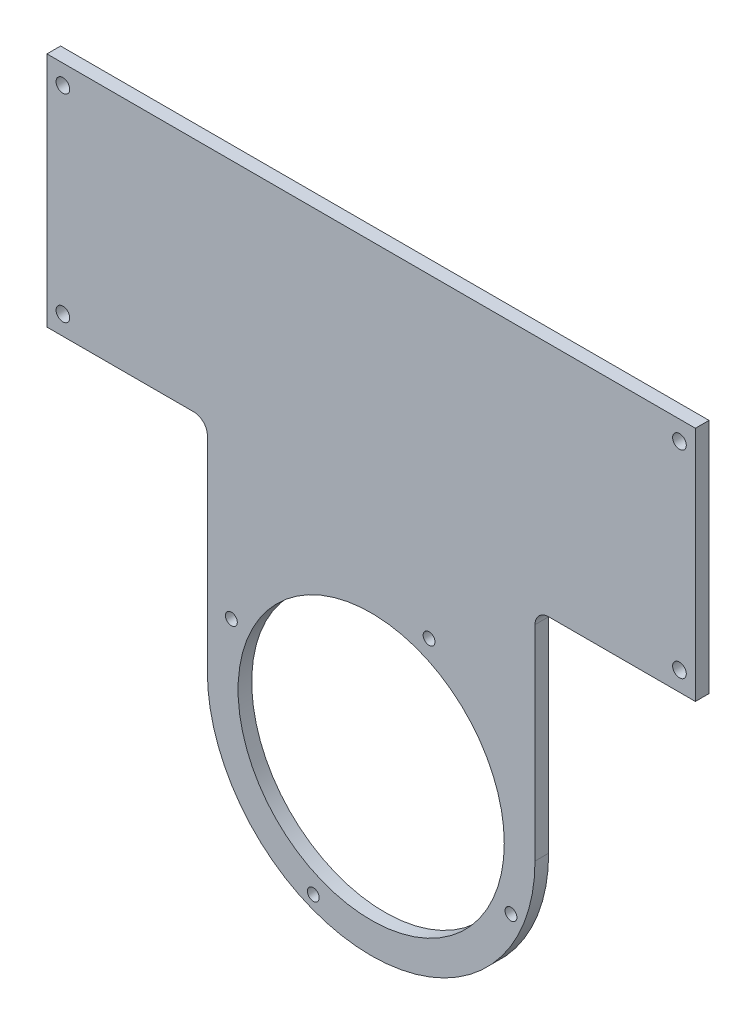
ISO-10303-21;
HEADER;
FILE_DESCRIPTION(('STEP AP214'),'2;1');
FILE_NAME('part.step','',(''),(''),'','','');
FILE_SCHEMA(('AUTOMOTIVE_DESIGN { 1 0 10303 214 1 1 1 1 }'));
ENDSEC;
DATA;
#1=APPLICATION_CONTEXT('core data for automotive mechanical design processes');
#2=APPLICATION_PROTOCOL_DEFINITION('international standard','automotive_design',2000,#1);
#3=PRODUCT_CONTEXT('',#1,'mechanical');
#4=PRODUCT('Part','Part','',(#3));
#5=PRODUCT_RELATED_PRODUCT_CATEGORY('part','',(#4));
#6=PRODUCT_DEFINITION_FORMATION('','',#4);
#7=PRODUCT_DEFINITION_CONTEXT('part definition',#1,'design');
#8=PRODUCT_DEFINITION('design','',#6,#7);
#9=PRODUCT_DEFINITION_SHAPE('','',#8);
#10=(LENGTH_UNIT() NAMED_UNIT(*) SI_UNIT(.MILLI.,.METRE.));
#11=(NAMED_UNIT(*) PLANE_ANGLE_UNIT() SI_UNIT($,.RADIAN.));
#12=(NAMED_UNIT(*) SI_UNIT($,.STERADIAN.) SOLID_ANGLE_UNIT());
#13=UNCERTAINTY_MEASURE_WITH_UNIT(LENGTH_MEASURE(1.E-05),#10,'distance_accuracy_value','');
#14=(GEOMETRIC_REPRESENTATION_CONTEXT(3) GLOBAL_UNCERTAINTY_ASSIGNED_CONTEXT((#13)) GLOBAL_UNIT_ASSIGNED_CONTEXT((#10,
#11,#12)) REPRESENTATION_CONTEXT('',''));
#15=CARTESIAN_POINT('',(0.,0.,0.));
#16=DIRECTION('',(0.,0.,1.));
#17=DIRECTION('',(1.,0.,0.));
#18=AXIS2_PLACEMENT_3D('',#15,#16,#17);
#19=CARTESIAN_POINT('',(0.,0.,3.));
#20=DIRECTION('',(0.,0.,1.));
#21=DIRECTION('',(1.,0.,0.));
#22=AXIS2_PLACEMENT_3D('',#19,#20,#21);
#23=PLANE('',#22);
#24=CARTESIAN_POINT('',(-30.7189944560003,12.7242241261393,3.));
#25=DIRECTION('',(0.,0.,1.));
#26=DIRECTION('',(1.,0.,0.));
#27=AXIS2_PLACEMENT_3D('',#24,#25,#26);
#28=CIRCLE('',#27,1.30000000000028);
#29=CARTESIAN_POINT('',(-29.418994456,12.7242241261393,3.));
#30=VERTEX_POINT('',#29);
#31=EDGE_CURVE('E482',#30,#30,#28,.T.);
#32=ORIENTED_EDGE('',*,*,#31,.F.);
#33=EDGE_LOOP('',(#32));
#34=FACE_BOUND('',#33,.T.);
#35=CARTESIAN_POINT('',(-12.7242241261393,-30.7189944560003,3.));
#36=DIRECTION('',(0.,0.,1.));
#37=DIRECTION('',(1.,0.,0.));
#38=AXIS2_PLACEMENT_3D('',#35,#36,#37);
#39=CIRCLE('',#38,1.30000000000018);
#40=CARTESIAN_POINT('',(-11.4242241261391,-30.7189944560003,3.));
#41=VERTEX_POINT('',#40);
#42=EDGE_CURVE('E486',#41,#41,#39,.T.);
#43=ORIENTED_EDGE('',*,*,#42,.F.);
#44=EDGE_LOOP('',(#43));
#45=FACE_BOUND('',#44,.T.);
#46=CARTESIAN_POINT('',(30.7189944560003,-12.7242241261393,3.));
#47=DIRECTION('',(0.,0.,1.));
#48=DIRECTION('',(1.,0.,0.));
#49=AXIS2_PLACEMENT_3D('',#46,#47,#48);
#50=CIRCLE('',#49,1.30000000000009);
#51=CARTESIAN_POINT('',(32.0189944560004,-12.7242241261393,3.));
#52=VERTEX_POINT('',#51);
#53=EDGE_CURVE('E499',#52,#52,#50,.T.);
#54=ORIENTED_EDGE('',*,*,#53,.F.);
#55=EDGE_LOOP('',(#54));
#56=FACE_BOUND('',#55,.T.);
#57=CARTESIAN_POINT('',(12.7242241261393,30.7189944560003,3.));
#58=DIRECTION('',(0.,0.,1.));
#59=DIRECTION('',(1.,0.,0.));
#60=AXIS2_PLACEMENT_3D('',#57,#58,#59);
#61=CIRCLE('',#60,1.3);
#62=CARTESIAN_POINT('',(14.0242241261393,30.7189944560003,3.));
#63=VERTEX_POINT('',#62);
#64=EDGE_CURVE('E507',#63,#63,#61,.T.);
#65=ORIENTED_EDGE('',*,*,#64,.F.);
#66=EDGE_LOOP('',(#65));
#67=FACE_BOUND('',#66,.T.);
#68=CARTESIAN_POINT('',(0.,0.,3.));
#69=DIRECTION('',(0.,0.,1.));
#70=DIRECTION('',(1.,0.,0.));
#71=AXIS2_PLACEMENT_3D('',#68,#69,#70);
#72=CIRCLE('',#71,29.25);
#73=CARTESIAN_POINT('',(29.25,0.,3.));
#74=VERTEX_POINT('',#73);
#75=EDGE_CURVE('E199',#74,#74,#72,.T.);
#76=ORIENTED_EDGE('',*,*,#75,.F.);
#77=EDGE_LOOP('',(#76));
#78=FACE_BOUND('',#77,.T.);
#79=CARTESIAN_POINT('',(67.75,52.25,3.));
#80=DIRECTION('',(0.,0.,1.));
#81=DIRECTION('',(1.,0.,0.));
#82=AXIS2_PLACEMENT_3D('',#79,#80,#81);
#83=CIRCLE('',#82,1.5);
#84=CARTESIAN_POINT('',(69.25,52.25,3.));
#85=VERTEX_POINT('',#84);
#86=EDGE_CURVE('E192',#85,#85,#83,.T.);
#87=ORIENTED_EDGE('',*,*,#86,.F.);
#88=EDGE_LOOP('',(#87));
#89=FACE_BOUND('',#88,.T.);
#90=CARTESIAN_POINT('',(-67.75,95.75,3.));
#91=DIRECTION('',(0.,0.,1.));
#92=DIRECTION('',(1.,0.,0.));
#93=AXIS2_PLACEMENT_3D('',#90,#91,#92);
#94=CIRCLE('',#93,1.5);
#95=CARTESIAN_POINT('',(-66.25,95.75,3.));
#96=VERTEX_POINT('',#95);
#97=EDGE_CURVE('E214',#96,#96,#94,.T.);
#98=ORIENTED_EDGE('',*,*,#97,.F.);
#99=EDGE_LOOP('',(#98));
#100=FACE_BOUND('',#99,.T.);
#101=DIRECTION('',(0.,1.,0.));
#102=VECTOR('',#101,1.);
#103=CARTESIAN_POINT('',(36.,0.,3.));
#104=LINE('',#103,#102);
#105=CARTESIAN_POINT('',(36.,0.,3.));
#106=VERTEX_POINT('',#105);
#107=CARTESIAN_POINT('',(36.,45.,3.));
#108=VERTEX_POINT('',#107);
#109=EDGE_CURVE('E162',#106,#108,#104,.T.);
#110=ORIENTED_EDGE('',*,*,#109,.T.);
#111=CARTESIAN_POINT('',(39.,45.,3.));
#112=DIRECTION('',(0.,0.,1.));
#113=DIRECTION('',(1.,0.,0.));
#114=AXIS2_PLACEMENT_3D('',#111,#112,#113);
#115=CIRCLE('',#114,3.);
#116=CARTESIAN_POINT('',(39.,48.,3.));
#117=VERTEX_POINT('',#116);
#118=EDGE_CURVE('E123',#108,#117,#115,.F.);
#119=ORIENTED_EDGE('',*,*,#118,.T.);
#120=DIRECTION('',(1.,0.,0.));
#121=VECTOR('',#120,1.);
#122=CARTESIAN_POINT('',(36.,48.,3.));
#123=LINE('',#122,#121);
#124=CARTESIAN_POINT('',(71.25,48.,3.));
#125=VERTEX_POINT('',#124);
#126=EDGE_CURVE('E116',#117,#125,#123,.T.);
#127=ORIENTED_EDGE('',*,*,#126,.T.);
#128=DIRECTION('',(0.,1.,0.));
#129=VECTOR('',#128,1.);
#130=CARTESIAN_POINT('',(71.25,100.,3.));
#131=LINE('',#130,#129);
#132=CARTESIAN_POINT('',(71.25,100.,3.));
#133=VERTEX_POINT('',#132);
#134=EDGE_CURVE('E120',#125,#133,#131,.T.);
#135=ORIENTED_EDGE('',*,*,#134,.T.);
#136=DIRECTION('',(-1.,0.,0.));
#137=VECTOR('',#136,1.);
#138=CARTESIAN_POINT('',(-71.25,100.,3.));
#139=LINE('',#138,#137);
#140=CARTESIAN_POINT('',(-71.25,100.,3.));
#141=VERTEX_POINT('',#140);
#142=EDGE_CURVE('E139',#133,#141,#139,.T.);
#143=ORIENTED_EDGE('',*,*,#142,.T.);
#144=DIRECTION('',(0.,-1.,0.));
#145=VECTOR('',#144,1.);
#146=CARTESIAN_POINT('',(-71.25,100.,3.));
#147=LINE('',#146,#145);
#148=CARTESIAN_POINT('',(-71.25,48.,3.));
#149=VERTEX_POINT('',#148);
#150=EDGE_CURVE('E166',#141,#149,#147,.T.);
#151=ORIENTED_EDGE('',*,*,#150,.T.);
#152=DIRECTION('',(1.,0.,0.));
#153=VECTOR('',#152,1.);
#154=CARTESIAN_POINT('',(-71.25,48.,3.));
#155=LINE('',#154,#153);
#156=CARTESIAN_POINT('',(-39.,48.,3.));
#157=VERTEX_POINT('',#156);
#158=EDGE_CURVE('E169',#149,#157,#155,.T.);
#159=ORIENTED_EDGE('',*,*,#158,.T.);
#160=CARTESIAN_POINT('',(-39.,45.,3.));
#161=DIRECTION('',(0.,0.,1.));
#162=DIRECTION('',(1.,0.,0.));
#163=AXIS2_PLACEMENT_3D('',#160,#161,#162);
#164=CIRCLE('',#163,3.);
#165=CARTESIAN_POINT('',(-36.,45.,3.));
#166=VERTEX_POINT('',#165);
#167=EDGE_CURVE('E12',#157,#166,#164,.F.);
#168=ORIENTED_EDGE('',*,*,#167,.T.);
#169=DIRECTION('',(0.,-1.,0.));
#170=VECTOR('',#169,1.);
#171=CARTESIAN_POINT('',(-36.,0.,3.));
#172=LINE('',#171,#170);
#173=CARTESIAN_POINT('',(-36.,0.,3.));
#174=VERTEX_POINT('',#173);
#175=EDGE_CURVE('E171',#166,#174,#172,.T.);
#176=ORIENTED_EDGE('',*,*,#175,.T.);
#177=CARTESIAN_POINT('',(0.,0.,3.));
#178=DIRECTION('',(0.,0.,1.));
#179=DIRECTION('',(1.,0.,0.));
#180=AXIS2_PLACEMENT_3D('',#177,#178,#179);
#181=CIRCLE('',#180,36.);
#182=EDGE_CURVE('E175',#174,#106,#181,.T.);
#183=ORIENTED_EDGE('',*,*,#182,.T.);
#184=EDGE_LOOP('',(#110,#119,#127,#135,#143,#151,#159,#168,#176,#183));
#185=FACE_BOUND('',#184,.T.);
#186=CARTESIAN_POINT('',(67.75,95.75,3.));
#187=DIRECTION('',(0.,0.,1.));
#188=DIRECTION('',(1.,0.,0.));
#189=AXIS2_PLACEMENT_3D('',#186,#187,#188);
#190=CIRCLE('',#189,1.5);
#191=CARTESIAN_POINT('',(69.25,95.75,3.));
#192=VERTEX_POINT('',#191);
#193=EDGE_CURVE('E179',#192,#192,#190,.T.);
#194=ORIENTED_EDGE('',*,*,#193,.F.);
#195=EDGE_LOOP('',(#194));
#196=FACE_BOUND('',#195,.T.);
#197=CARTESIAN_POINT('',(-67.75,52.25,3.));
#198=DIRECTION('',(0.,0.,1.));
#199=DIRECTION('',(1.,0.,0.));
#200=AXIS2_PLACEMENT_3D('',#197,#198,#199);
#201=CIRCLE('',#200,1.5);
#202=CARTESIAN_POINT('',(-66.25,52.25,3.));
#203=VERTEX_POINT('',#202);
#204=EDGE_CURVE('E185',#203,#203,#201,.T.);
#205=ORIENTED_EDGE('',*,*,#204,.F.);
#206=EDGE_LOOP('',(#205));
#207=FACE_BOUND('',#206,.T.);
#208=ADVANCED_FACE('F39',(#34,#45,#56,#67,#78,#89,#100,#185,#196,#207),#23,.T.);
#209=CARTESIAN_POINT('',(0.,0.,0.));
#210=DIRECTION('',(0.,0.,1.));
#211=DIRECTION('',(1.,0.,0.));
#212=AXIS2_PLACEMENT_3D('',#209,#210,#211);
#213=PLANE('',#212);
#214=CARTESIAN_POINT('',(-30.7189944560003,12.7242241261393,0.));
#215=DIRECTION('',(0.,0.,1.));
#216=DIRECTION('',(1.,0.,0.));
#217=AXIS2_PLACEMENT_3D('',#214,#215,#216);
#218=CIRCLE('',#217,1.30000000000028);
#219=CARTESIAN_POINT('',(-29.418994456,12.7242241261393,0.));
#220=VERTEX_POINT('',#219);
#221=EDGE_CURVE('E480',#220,#220,#218,.T.);
#222=ORIENTED_EDGE('',*,*,#221,.T.);
#223=EDGE_LOOP('',(#222));
#224=FACE_BOUND('',#223,.T.);
#225=CARTESIAN_POINT('',(-12.7242241261393,-30.7189944560003,0.));
#226=DIRECTION('',(0.,0.,1.));
#227=DIRECTION('',(1.,0.,0.));
#228=AXIS2_PLACEMENT_3D('',#225,#226,#227);
#229=CIRCLE('',#228,1.30000000000018);
#230=CARTESIAN_POINT('',(-11.4242241261391,-30.7189944560003,0.));
#231=VERTEX_POINT('',#230);
#232=EDGE_CURVE('E497',#231,#231,#229,.T.);
#233=ORIENTED_EDGE('',*,*,#232,.T.);
#234=EDGE_LOOP('',(#233));
#235=FACE_BOUND('',#234,.T.);
#236=CARTESIAN_POINT('',(30.7189944560003,-12.7242241261393,0.));
#237=DIRECTION('',(0.,0.,1.));
#238=DIRECTION('',(1.,0.,0.));
#239=AXIS2_PLACEMENT_3D('',#236,#237,#238);
#240=CIRCLE('',#239,1.30000000000009);
#241=CARTESIAN_POINT('',(32.0189944560004,-12.7242241261393,0.));
#242=VERTEX_POINT('',#241);
#243=EDGE_CURVE('E504',#242,#242,#240,.T.);
#244=ORIENTED_EDGE('',*,*,#243,.T.);
#245=EDGE_LOOP('',(#244));
#246=FACE_BOUND('',#245,.T.);
#247=CARTESIAN_POINT('',(12.7242241261393,30.7189944560003,0.));
#248=DIRECTION('',(0.,0.,1.));
#249=DIRECTION('',(1.,0.,0.));
#250=AXIS2_PLACEMENT_3D('',#247,#248,#249);
#251=CIRCLE('',#250,1.3);
#252=CARTESIAN_POINT('',(14.0242241261393,30.7189944560003,0.));
#253=VERTEX_POINT('',#252);
#254=EDGE_CURVE('E512',#253,#253,#251,.T.);
#255=ORIENTED_EDGE('',*,*,#254,.T.);
#256=EDGE_LOOP('',(#255));
#257=FACE_BOUND('',#256,.T.);
#258=CARTESIAN_POINT('',(0.,0.,0.));
#259=DIRECTION('',(0.,0.,1.));
#260=DIRECTION('',(1.,0.,0.));
#261=AXIS2_PLACEMENT_3D('',#258,#259,#260);
#262=CIRCLE('',#261,29.25);
#263=CARTESIAN_POINT('',(29.25,0.,0.));
#264=VERTEX_POINT('',#263);
#265=EDGE_CURVE('E195',#264,#264,#262,.T.);
#266=ORIENTED_EDGE('',*,*,#265,.T.);
#267=EDGE_LOOP('',(#266));
#268=FACE_BOUND('',#267,.T.);
#269=DIRECTION('',(1.,0.,0.));
#270=VECTOR('',#269,1.);
#271=CARTESIAN_POINT('',(36.,48.,0.));
#272=LINE('',#271,#270);
#273=CARTESIAN_POINT('',(39.,48.,0.));
#274=VERTEX_POINT('',#273);
#275=CARTESIAN_POINT('',(71.25,48.,0.));
#276=VERTEX_POINT('',#275);
#277=EDGE_CURVE('E143',#274,#276,#272,.T.);
#278=ORIENTED_EDGE('',*,*,#277,.F.);
#279=CARTESIAN_POINT('',(39.,45.,0.));
#280=DIRECTION('',(0.,0.,1.));
#281=DIRECTION('',(1.,0.,0.));
#282=AXIS2_PLACEMENT_3D('',#279,#280,#281);
#283=CIRCLE('',#282,3.);
#284=CARTESIAN_POINT('',(36.,45.,0.));
#285=VERTEX_POINT('',#284);
#286=EDGE_CURVE('E158',#274,#285,#283,.T.);
#287=ORIENTED_EDGE('',*,*,#286,.T.);
#288=DIRECTION('',(0.,1.,0.));
#289=VECTOR('',#288,1.);
#290=CARTESIAN_POINT('',(36.,0.,0.));
#291=LINE('',#290,#289);
#292=CARTESIAN_POINT('',(36.,0.,0.));
#293=VERTEX_POINT('',#292);
#294=EDGE_CURVE('E129',#293,#285,#291,.T.);
#295=ORIENTED_EDGE('',*,*,#294,.F.);
#296=CARTESIAN_POINT('',(0.,0.,0.));
#297=DIRECTION('',(0.,0.,1.));
#298=DIRECTION('',(1.,0.,0.));
#299=AXIS2_PLACEMENT_3D('',#296,#297,#298);
#300=CIRCLE('',#299,36.);
#301=CARTESIAN_POINT('',(-36.,0.,0.));
#302=VERTEX_POINT('',#301);
#303=EDGE_CURVE('E247',#302,#293,#300,.T.);
#304=ORIENTED_EDGE('',*,*,#303,.F.);
#305=DIRECTION('',(0.,-1.,0.));
#306=VECTOR('',#305,1.);
#307=CARTESIAN_POINT('',(-36.,0.,0.));
#308=LINE('',#307,#306);
#309=CARTESIAN_POINT('',(-36.,45.,0.));
#310=VERTEX_POINT('',#309);
#311=EDGE_CURVE('E245',#310,#302,#308,.T.);
#312=ORIENTED_EDGE('',*,*,#311,.F.);
#313=CARTESIAN_POINT('',(-39.,45.,0.));
#314=DIRECTION('',(0.,0.,1.));
#315=DIRECTION('',(1.,0.,0.));
#316=AXIS2_PLACEMENT_3D('',#313,#314,#315);
#317=CIRCLE('',#316,3.);
#318=CARTESIAN_POINT('',(-39.,48.,0.));
#319=VERTEX_POINT('',#318);
#320=EDGE_CURVE('E48',#310,#319,#317,.T.);
#321=ORIENTED_EDGE('',*,*,#320,.T.);
#322=DIRECTION('',(1.,0.,0.));
#323=VECTOR('',#322,1.);
#324=CARTESIAN_POINT('',(-71.25,48.,0.));
#325=LINE('',#324,#323);
#326=CARTESIAN_POINT('',(-71.25,48.,0.));
#327=VERTEX_POINT('',#326);
#328=EDGE_CURVE('E243',#327,#319,#325,.T.);
#329=ORIENTED_EDGE('',*,*,#328,.F.);
#330=DIRECTION('',(0.,-1.,0.));
#331=VECTOR('',#330,1.);
#332=CARTESIAN_POINT('',(-71.25,100.,0.));
#333=LINE('',#332,#331);
#334=CARTESIAN_POINT('',(-71.25,100.,0.));
#335=VERTEX_POINT('',#334);
#336=EDGE_CURVE('E241',#335,#327,#333,.T.);
#337=ORIENTED_EDGE('',*,*,#336,.F.);
#338=DIRECTION('',(-1.,0.,0.));
#339=VECTOR('',#338,1.);
#340=CARTESIAN_POINT('',(-71.25,100.,0.));
#341=LINE('',#340,#339);
#342=CARTESIAN_POINT('',(71.25,100.,0.));
#343=VERTEX_POINT('',#342);
#344=EDGE_CURVE('E239',#343,#335,#341,.T.);
#345=ORIENTED_EDGE('',*,*,#344,.F.);
#346=DIRECTION('',(0.,1.,0.));
#347=VECTOR('',#346,1.);
#348=CARTESIAN_POINT('',(71.25,100.,0.));
#349=LINE('',#348,#347);
#350=EDGE_CURVE('E237',#276,#343,#349,.T.);
#351=ORIENTED_EDGE('',*,*,#350,.F.);
#352=EDGE_LOOP('',(#278,#287,#295,#304,#312,#321,#329,#337,#345,#351));
#353=FACE_BOUND('',#352,.T.);
#354=CARTESIAN_POINT('',(-67.75,95.75,0.));
#355=DIRECTION('',(0.,0.,1.));
#356=DIRECTION('',(1.,0.,0.));
#357=AXIS2_PLACEMENT_3D('',#354,#355,#356);
#358=CIRCLE('',#357,1.5);
#359=CARTESIAN_POINT('',(-66.25,95.75,0.));
#360=VERTEX_POINT('',#359);
#361=EDGE_CURVE('E182',#360,#360,#358,.T.);
#362=ORIENTED_EDGE('',*,*,#361,.T.);
#363=EDGE_LOOP('',(#362));
#364=FACE_BOUND('',#363,.T.);
#365=CARTESIAN_POINT('',(67.75,95.75,0.));
#366=DIRECTION('',(0.,0.,1.));
#367=DIRECTION('',(1.,0.,0.));
#368=AXIS2_PLACEMENT_3D('',#365,#366,#367);
#369=CIRCLE('',#368,1.5);
#370=CARTESIAN_POINT('',(69.25,95.75,0.));
#371=VERTEX_POINT('',#370);
#372=EDGE_CURVE('E183',#371,#371,#369,.T.);
#373=ORIENTED_EDGE('',*,*,#372,.T.);
#374=EDGE_LOOP('',(#373));
#375=FACE_BOUND('',#374,.T.);
#376=CARTESIAN_POINT('',(67.75,52.25,0.));
#377=DIRECTION('',(0.,0.,1.));
#378=DIRECTION('',(1.,0.,0.));
#379=AXIS2_PLACEMENT_3D('',#376,#377,#378);
#380=CIRCLE('',#379,1.5);
#381=CARTESIAN_POINT('',(69.25,52.25,0.));
#382=VERTEX_POINT('',#381);
#383=EDGE_CURVE('E187',#382,#382,#380,.T.);
#384=ORIENTED_EDGE('',*,*,#383,.T.);
#385=EDGE_LOOP('',(#384));
#386=FACE_BOUND('',#385,.T.);
#387=CARTESIAN_POINT('',(-67.75,52.25,0.));
#388=DIRECTION('',(0.,0.,1.));
#389=DIRECTION('',(1.,0.,0.));
#390=AXIS2_PLACEMENT_3D('',#387,#388,#389);
#391=CIRCLE('',#390,1.5);
#392=CARTESIAN_POINT('',(-66.25,52.25,0.));
#393=VERTEX_POINT('',#392);
#394=EDGE_CURVE('E188',#393,#393,#391,.T.);
#395=ORIENTED_EDGE('',*,*,#394,.T.);
#396=EDGE_LOOP('',(#395));
#397=FACE_BOUND('',#396,.T.);
#398=ADVANCED_FACE('F267',(#224,#235,#246,#257,#268,#353,#364,#375,#386,#397),#213,.F.);
#399=CARTESIAN_POINT('',(36.,48.,3.));
#400=DIRECTION('',(0.,1.,0.));
#401=DIRECTION('',(0.,0.,1.));
#402=AXIS2_PLACEMENT_3D('',#399,#400,#401);
#403=PLANE('',#402);
#404=ORIENTED_EDGE('',*,*,#126,.F.);
#405=DIRECTION('',(0.,0.,-1.));
#406=VECTOR('',#405,1.);
#407=CARTESIAN_POINT('',(39.,48.,0.));
#408=LINE('',#407,#406);
#409=EDGE_CURVE('E145',#117,#274,#408,.T.);
#410=ORIENTED_EDGE('',*,*,#409,.T.);
#411=ORIENTED_EDGE('',*,*,#277,.T.);
#412=DIRECTION('',(0.,0.,-1.));
#413=VECTOR('',#412,1.);
#414=CARTESIAN_POINT('',(71.25,48.,3.));
#415=LINE('',#414,#413);
#416=EDGE_CURVE('E134',#125,#276,#415,.T.);
#417=ORIENTED_EDGE('',*,*,#416,.F.);
#418=EDGE_LOOP('',(#404,#410,#411,#417));
#419=FACE_BOUND('',#418,.T.);
#420=ADVANCED_FACE('F141',(#419),#403,.F.);
#421=CARTESIAN_POINT('',(71.25,100.,3.));
#422=DIRECTION('',(-1.,0.,0.));
#423=DIRECTION('',(0.,0.,1.));
#424=AXIS2_PLACEMENT_3D('',#421,#422,#423);
#425=PLANE('',#424);
#426=ORIENTED_EDGE('',*,*,#350,.T.);
#427=DIRECTION('',(0.,0.,-1.));
#428=VECTOR('',#427,1.);
#429=CARTESIAN_POINT('',(71.25,100.,3.));
#430=LINE('',#429,#428);
#431=EDGE_CURVE('E136',#133,#343,#430,.T.);
#432=ORIENTED_EDGE('',*,*,#431,.F.);
#433=ORIENTED_EDGE('',*,*,#134,.F.);
#434=ORIENTED_EDGE('',*,*,#416,.T.);
#435=EDGE_LOOP('',(#426,#432,#433,#434));
#436=FACE_BOUND('',#435,.T.);
#437=ADVANCED_FACE('F133',(#436),#425,.F.);
#438=CARTESIAN_POINT('',(-71.25,100.,3.));
#439=DIRECTION('',(0.,-1.,0.));
#440=DIRECTION('',(0.,0.,-1.));
#441=AXIS2_PLACEMENT_3D('',#438,#439,#440);
#442=PLANE('',#441);
#443=ORIENTED_EDGE('',*,*,#344,.T.);
#444=DIRECTION('',(0.,0.,-1.));
#445=VECTOR('',#444,1.);
#446=CARTESIAN_POINT('',(-71.25,100.,3.));
#447=LINE('',#446,#445);
#448=EDGE_CURVE('E149',#141,#335,#447,.T.);
#449=ORIENTED_EDGE('',*,*,#448,.F.);
#450=ORIENTED_EDGE('',*,*,#142,.F.);
#451=ORIENTED_EDGE('',*,*,#431,.T.);
#452=EDGE_LOOP('',(#443,#449,#450,#451));
#453=FACE_BOUND('',#452,.T.);
#454=ADVANCED_FACE('F288',(#453),#442,.F.);
#455=CARTESIAN_POINT('',(-71.25,100.,3.));
#456=DIRECTION('',(1.,0.,0.));
#457=DIRECTION('',(0.,0.,-1.));
#458=AXIS2_PLACEMENT_3D('',#455,#456,#457);
#459=PLANE('',#458);
#460=ORIENTED_EDGE('',*,*,#336,.T.);
#461=DIRECTION('',(0.,0.,-1.));
#462=VECTOR('',#461,1.);
#463=CARTESIAN_POINT('',(-71.25,48.,3.));
#464=LINE('',#463,#462);
#465=EDGE_CURVE('E256',#149,#327,#464,.T.);
#466=ORIENTED_EDGE('',*,*,#465,.F.);
#467=ORIENTED_EDGE('',*,*,#150,.F.);
#468=ORIENTED_EDGE('',*,*,#448,.T.);
#469=EDGE_LOOP('',(#460,#466,#467,#468));
#470=FACE_BOUND('',#469,.T.);
#471=ADVANCED_FACE('F263',(#470),#459,.F.);
#472=CARTESIAN_POINT('',(-71.25,48.,3.));
#473=DIRECTION('',(0.,1.,0.));
#474=DIRECTION('',(0.,0.,1.));
#475=AXIS2_PLACEMENT_3D('',#472,#473,#474);
#476=PLANE('',#475);
#477=ORIENTED_EDGE('',*,*,#328,.T.);
#478=DIRECTION('',(0.,0.,-1.));
#479=VECTOR('',#478,1.);
#480=CARTESIAN_POINT('',(-39.,48.,3.));
#481=LINE('',#480,#479);
#482=EDGE_CURVE('E55',#319,#157,#481,.F.);
#483=ORIENTED_EDGE('',*,*,#482,.T.);
#484=ORIENTED_EDGE('',*,*,#158,.F.);
#485=ORIENTED_EDGE('',*,*,#465,.T.);
#486=EDGE_LOOP('',(#477,#483,#484,#485));
#487=FACE_BOUND('',#486,.T.);
#488=ADVANCED_FACE('F269',(#487),#476,.F.);
#489=CARTESIAN_POINT('',(-36.,0.,3.));
#490=DIRECTION('',(1.,0.,0.));
#491=DIRECTION('',(0.,0.,-1.));
#492=AXIS2_PLACEMENT_3D('',#489,#490,#491);
#493=PLANE('',#492);
#494=ORIENTED_EDGE('',*,*,#175,.F.);
#495=DIRECTION('',(0.,0.,-1.));
#496=VECTOR('',#495,1.);
#497=CARTESIAN_POINT('',(-36.,45.,0.));
#498=LINE('',#497,#496);
#499=EDGE_CURVE('E154',#166,#310,#498,.T.);
#500=ORIENTED_EDGE('',*,*,#499,.T.);
#501=ORIENTED_EDGE('',*,*,#311,.T.);
#502=DIRECTION('',(0.,0.,-1.));
#503=VECTOR('',#502,1.);
#504=CARTESIAN_POINT('',(-36.,0.,3.));
#505=LINE('',#504,#503);
#506=EDGE_CURVE('E253',#174,#302,#505,.T.);
#507=ORIENTED_EDGE('',*,*,#506,.F.);
#508=EDGE_LOOP('',(#494,#500,#501,#507));
#509=FACE_BOUND('',#508,.T.);
#510=ADVANCED_FACE('F276',(#509),#493,.F.);
#511=CARTESIAN_POINT('',(0.,0.,3.));
#512=DIRECTION('',(0.,0.,-1.));
#513=DIRECTION('',(-1.,0.,0.));
#514=AXIS2_PLACEMENT_3D('',#511,#512,#513);
#515=CYLINDRICAL_SURFACE('',#514,36.);
#516=ORIENTED_EDGE('',*,*,#303,.T.);
#517=DIRECTION('',(0.,0.,-1.));
#518=VECTOR('',#517,1.);
#519=CARTESIAN_POINT('',(36.,0.,3.));
#520=LINE('',#519,#518);
#521=EDGE_CURVE('E235',#106,#293,#520,.T.);
#522=ORIENTED_EDGE('',*,*,#521,.F.);
#523=ORIENTED_EDGE('',*,*,#182,.F.);
#524=ORIENTED_EDGE('',*,*,#506,.T.);
#525=EDGE_LOOP('',(#516,#522,#523,#524));
#526=FACE_BOUND('',#525,.T.);
#527=ADVANCED_FACE('F281',(#526),#515,.T.);
#528=CARTESIAN_POINT('',(36.,0.,3.));
#529=DIRECTION('',(-1.,0.,0.));
#530=DIRECTION('',(0.,-1.,0.));
#531=AXIS2_PLACEMENT_3D('',#528,#529,#530);
#532=PLANE('',#531);
#533=ORIENTED_EDGE('',*,*,#294,.T.);
#534=DIRECTION('',(0.,0.,-1.));
#535=VECTOR('',#534,1.);
#536=CARTESIAN_POINT('',(36.,45.,3.));
#537=LINE('',#536,#535);
#538=EDGE_CURVE('E147',#285,#108,#537,.F.);
#539=ORIENTED_EDGE('',*,*,#538,.T.);
#540=ORIENTED_EDGE('',*,*,#109,.F.);
#541=ORIENTED_EDGE('',*,*,#521,.T.);
#542=EDGE_LOOP('',(#533,#539,#540,#541));
#543=FACE_BOUND('',#542,.T.);
#544=ADVANCED_FACE('F311',(#543),#532,.F.);
#545=CARTESIAN_POINT('',(-67.75,95.75,3.));
#546=DIRECTION('',(0.,0.,-1.));
#547=DIRECTION('',(-1.,0.,0.));
#548=AXIS2_PLACEMENT_3D('',#545,#546,#547);
#549=CYLINDRICAL_SURFACE('',#548,1.5);
#550=ORIENTED_EDGE('',*,*,#97,.T.);
#551=EDGE_LOOP('',(#550));
#552=FACE_BOUND('',#551,.T.);
#553=ORIENTED_EDGE('',*,*,#361,.F.);
#554=EDGE_LOOP('',(#553));
#555=FACE_BOUND('',#554,.T.);
#556=ADVANCED_FACE('F308',(#552,#555),#549,.F.);
#557=CARTESIAN_POINT('',(67.75,95.75,3.));
#558=DIRECTION('',(0.,0.,-1.));
#559=DIRECTION('',(-1.,0.,0.));
#560=AXIS2_PLACEMENT_3D('',#557,#558,#559);
#561=CYLINDRICAL_SURFACE('',#560,1.5);
#562=ORIENTED_EDGE('',*,*,#193,.T.);
#563=EDGE_LOOP('',(#562));
#564=FACE_BOUND('',#563,.T.);
#565=ORIENTED_EDGE('',*,*,#372,.F.);
#566=EDGE_LOOP('',(#565));
#567=FACE_BOUND('',#566,.T.);
#568=ADVANCED_FACE('F343',(#564,#567),#561,.F.);
#569=CARTESIAN_POINT('',(67.75,52.25,3.));
#570=DIRECTION('',(0.,0.,-1.));
#571=DIRECTION('',(-1.,0.,0.));
#572=AXIS2_PLACEMENT_3D('',#569,#570,#571);
#573=CYLINDRICAL_SURFACE('',#572,1.5);
#574=ORIENTED_EDGE('',*,*,#86,.T.);
#575=EDGE_LOOP('',(#574));
#576=FACE_BOUND('',#575,.T.);
#577=ORIENTED_EDGE('',*,*,#383,.F.);
#578=EDGE_LOOP('',(#577));
#579=FACE_BOUND('',#578,.T.);
#580=ADVANCED_FACE('F350',(#576,#579),#573,.F.);
#581=CARTESIAN_POINT('',(-67.75,52.25,3.));
#582=DIRECTION('',(0.,0.,-1.));
#583=DIRECTION('',(-1.,0.,0.));
#584=AXIS2_PLACEMENT_3D('',#581,#582,#583);
#585=CYLINDRICAL_SURFACE('',#584,1.5);
#586=ORIENTED_EDGE('',*,*,#204,.T.);
#587=EDGE_LOOP('',(#586));
#588=FACE_BOUND('',#587,.T.);
#589=ORIENTED_EDGE('',*,*,#394,.F.);
#590=EDGE_LOOP('',(#589));
#591=FACE_BOUND('',#590,.T.);
#592=ADVANCED_FACE('F357',(#588,#591),#585,.F.);
#593=CARTESIAN_POINT('',(39.,45.,3.));
#594=DIRECTION('',(0.,0.,1.));
#595=DIRECTION('',(1.,0.,0.));
#596=AXIS2_PLACEMENT_3D('',#593,#594,#595);
#597=CYLINDRICAL_SURFACE('',#596,3.);
#598=ORIENTED_EDGE('',*,*,#118,.F.);
#599=ORIENTED_EDGE('',*,*,#538,.F.);
#600=ORIENTED_EDGE('',*,*,#286,.F.);
#601=ORIENTED_EDGE('',*,*,#409,.F.);
#602=EDGE_LOOP('',(#598,#599,#600,#601));
#603=FACE_BOUND('',#602,.T.);
#604=ADVANCED_FACE('F286',(#603),#597,.F.);
#605=CARTESIAN_POINT('',(-39.,45.,3.));
#606=DIRECTION('',(0.,0.,1.));
#607=DIRECTION('',(1.,0.,0.));
#608=AXIS2_PLACEMENT_3D('',#605,#606,#607);
#609=CYLINDRICAL_SURFACE('',#608,3.);
#610=ORIENTED_EDGE('',*,*,#167,.F.);
#611=ORIENTED_EDGE('',*,*,#482,.F.);
#612=ORIENTED_EDGE('',*,*,#320,.F.);
#613=ORIENTED_EDGE('',*,*,#499,.F.);
#614=EDGE_LOOP('',(#610,#611,#612,#613));
#615=FACE_BOUND('',#614,.T.);
#616=ADVANCED_FACE('F41',(#615),#609,.F.);
#617=CARTESIAN_POINT('',(0.,0.,0.));
#618=DIRECTION('',(0.,0.,1.));
#619=DIRECTION('',(1.,0.,0.));
#620=AXIS2_PLACEMENT_3D('',#617,#618,#619);
#621=CYLINDRICAL_SURFACE('',#620,29.25);
#622=ORIENTED_EDGE('',*,*,#265,.F.);
#623=EDGE_LOOP('',(#622));
#624=FACE_BOUND('',#623,.T.);
#625=ORIENTED_EDGE('',*,*,#75,.T.);
#626=EDGE_LOOP('',(#625));
#627=FACE_BOUND('',#626,.T.);
#628=ADVANCED_FACE('F375',(#624,#627),#621,.F.);
#629=CARTESIAN_POINT('',(12.7242241261393,30.7189944560003,0.));
#630=DIRECTION('',(0.,0.,1.));
#631=DIRECTION('',(1.,0.,0.));
#632=AXIS2_PLACEMENT_3D('',#629,#630,#631);
#633=CYLINDRICAL_SURFACE('',#632,1.3);
#634=ORIENTED_EDGE('',*,*,#254,.F.);
#635=EDGE_LOOP('',(#634));
#636=FACE_BOUND('',#635,.T.);
#637=ORIENTED_EDGE('',*,*,#64,.T.);
#638=EDGE_LOOP('',(#637));
#639=FACE_BOUND('',#638,.T.);
#640=ADVANCED_FACE('F381',(#636,#639),#633,.F.);
#641=CARTESIAN_POINT('',(30.7189944560003,-12.7242241261393,0.));
#642=DIRECTION('',(0.,0.,1.));
#643=DIRECTION('',(1.,0.,0.));
#644=AXIS2_PLACEMENT_3D('',#641,#642,#643);
#645=CYLINDRICAL_SURFACE('',#644,1.30000000000009);
#646=ORIENTED_EDGE('',*,*,#243,.F.);
#647=EDGE_LOOP('',(#646));
#648=FACE_BOUND('',#647,.T.);
#649=ORIENTED_EDGE('',*,*,#53,.T.);
#650=EDGE_LOOP('',(#649));
#651=FACE_BOUND('',#650,.T.);
#652=ADVANCED_FACE('F390',(#648,#651),#645,.F.);
#653=CARTESIAN_POINT('',(-12.7242241261393,-30.7189944560003,0.));
#654=DIRECTION('',(0.,0.,1.));
#655=DIRECTION('',(1.,0.,0.));
#656=AXIS2_PLACEMENT_3D('',#653,#654,#655);
#657=CYLINDRICAL_SURFACE('',#656,1.30000000000018);
#658=ORIENTED_EDGE('',*,*,#232,.F.);
#659=EDGE_LOOP('',(#658));
#660=FACE_BOUND('',#659,.T.);
#661=ORIENTED_EDGE('',*,*,#42,.T.);
#662=EDGE_LOOP('',(#661));
#663=FACE_BOUND('',#662,.T.);
#664=ADVANCED_FACE('F398',(#660,#663),#657,.F.);
#665=CARTESIAN_POINT('',(-30.7189944560003,12.7242241261393,0.));
#666=DIRECTION('',(0.,0.,1.));
#667=DIRECTION('',(1.,0.,0.));
#668=AXIS2_PLACEMENT_3D('',#665,#666,#667);
#669=CYLINDRICAL_SURFACE('',#668,1.30000000000028);
#670=ORIENTED_EDGE('',*,*,#221,.F.);
#671=EDGE_LOOP('',(#670));
#672=FACE_BOUND('',#671,.T.);
#673=ORIENTED_EDGE('',*,*,#31,.T.);
#674=EDGE_LOOP('',(#673));
#675=FACE_BOUND('',#674,.T.);
#676=ADVANCED_FACE('F406',(#672,#675),#669,.F.);
#677=CLOSED_SHELL('',(#208,#398,#420,#437,#454,#471,#488,#510,#527,#544,#556,#568,#580,#592,
#604,#616,#628,#640,#652,#664,#676));
#678=MANIFOLD_SOLID_BREP('B2',#677);
#679=ADVANCED_BREP_SHAPE_REPRESENTATION('',(#18,#678),#14);
#680=SHAPE_DEFINITION_REPRESENTATION(#9,#679);
ENDSEC;
END-ISO-10303-21;
